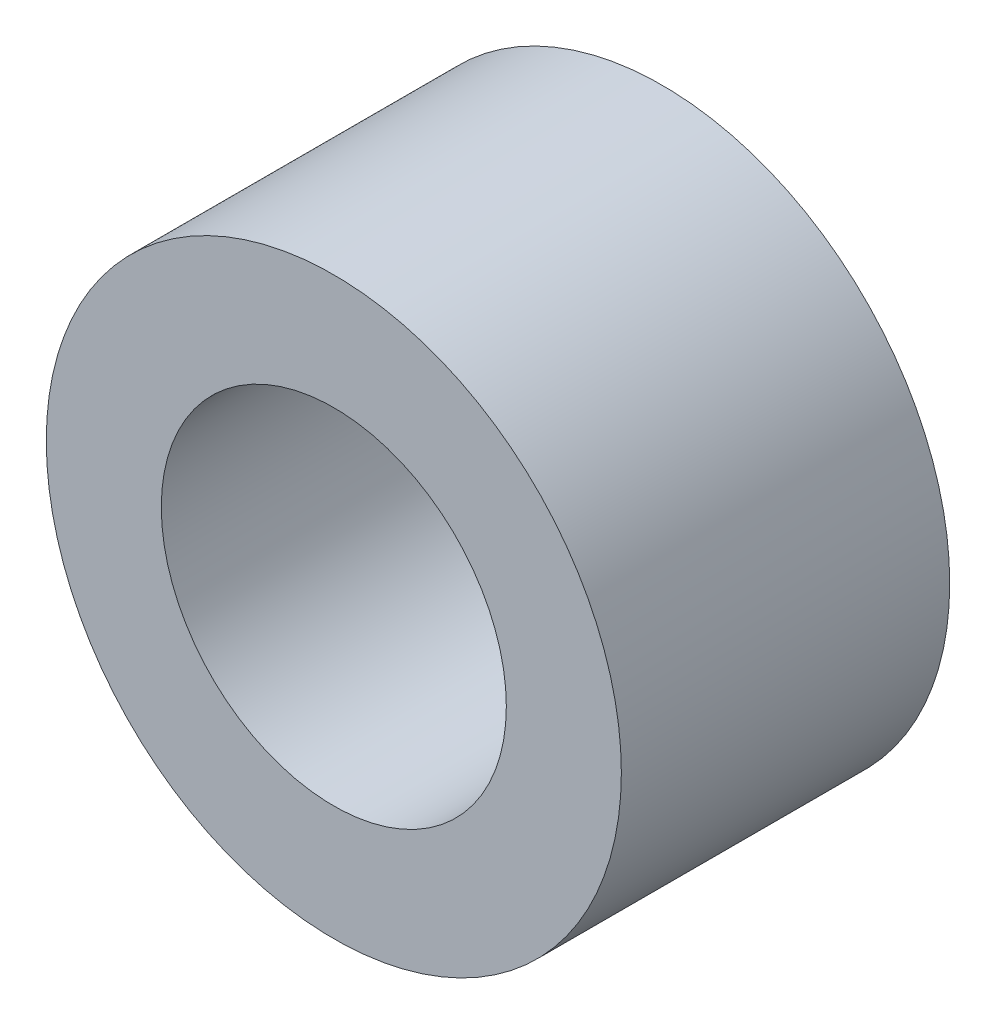
ISO-10303-21;
HEADER;
FILE_DESCRIPTION(('STEP AP214'),'2;1');
FILE_NAME('part.step','',(''),(''),'','','');
FILE_SCHEMA(('AUTOMOTIVE_DESIGN { 1 0 10303 214 1 1 1 1 }'));
ENDSEC;
DATA;
#1=APPLICATION_CONTEXT('core data for automotive mechanical design processes');
#2=APPLICATION_PROTOCOL_DEFINITION('international standard','automotive_design',2000,#1);
#3=PRODUCT_CONTEXT('',#1,'mechanical');
#4=PRODUCT('Part','Part','',(#3));
#5=PRODUCT_RELATED_PRODUCT_CATEGORY('part','',(#4));
#6=PRODUCT_DEFINITION_FORMATION('','',#4);
#7=PRODUCT_DEFINITION_CONTEXT('part definition',#1,'design');
#8=PRODUCT_DEFINITION('design','',#6,#7);
#9=PRODUCT_DEFINITION_SHAPE('','',#8);
#10=(LENGTH_UNIT() NAMED_UNIT(*) SI_UNIT(.MILLI.,.METRE.));
#11=(NAMED_UNIT(*) PLANE_ANGLE_UNIT() SI_UNIT($,.RADIAN.));
#12=(NAMED_UNIT(*) SI_UNIT($,.STERADIAN.) SOLID_ANGLE_UNIT());
#13=UNCERTAINTY_MEASURE_WITH_UNIT(LENGTH_MEASURE(1.E-05),#10,'distance_accuracy_value','');
#14=(GEOMETRIC_REPRESENTATION_CONTEXT(3) GLOBAL_UNCERTAINTY_ASSIGNED_CONTEXT((#13)) GLOBAL_UNIT_ASSIGNED_CONTEXT((#10,
#11,#12)) REPRESENTATION_CONTEXT('',''));
#15=CARTESIAN_POINT('',(0.,0.,0.));
#16=DIRECTION('',(0.,0.,1.));
#17=DIRECTION('',(1.,0.,0.));
#18=AXIS2_PLACEMENT_3D('',#15,#16,#17);
#19=CARTESIAN_POINT('',(0.,0.,14.5034));
#20=DIRECTION('',(0.,0.,1.));
#21=DIRECTION('',(1.,0.,0.));
#22=AXIS2_PLACEMENT_3D('',#19,#20,#21);
#23=PLANE('',#22);
#24=CARTESIAN_POINT('',(0.,0.,14.5034));
#25=DIRECTION('',(0.,0.,1.));
#26=DIRECTION('',(1.,0.,0.));
#27=AXIS2_PLACEMENT_3D('',#24,#25,#26);
#28=CIRCLE('',#27,12.7);
#29=CARTESIAN_POINT('',(12.7,0.,14.5034));
#30=VERTEX_POINT('',#29);
#31=EDGE_CURVE('E10',#30,#30,#28,.T.);
#32=ORIENTED_EDGE('',*,*,#31,.T.);
#33=EDGE_LOOP('',(#32));
#34=FACE_BOUND('',#33,.T.);
#35=CARTESIAN_POINT('',(0.,0.,14.5034));
#36=DIRECTION('',(0.,0.,1.));
#37=DIRECTION('',(1.,0.,0.));
#38=AXIS2_PLACEMENT_3D('',#35,#36,#37);
#39=CIRCLE('',#38,7.62);
#40=CARTESIAN_POINT('',(7.62,0.,14.5034));
#41=VERTEX_POINT('',#40);
#42=EDGE_CURVE('E44',#41,#41,#39,.T.);
#43=ORIENTED_EDGE('',*,*,#42,.F.);
#44=EDGE_LOOP('',(#43));
#45=FACE_BOUND('',#44,.T.);
#46=ADVANCED_FACE('F33',(#34,#45),#23,.T.);
#47=CARTESIAN_POINT('',(0.,0.,0.));
#48=DIRECTION('',(0.,0.,1.));
#49=DIRECTION('',(1.,0.,0.));
#50=AXIS2_PLACEMENT_3D('',#47,#48,#49);
#51=PLANE('',#50);
#52=CARTESIAN_POINT('',(0.,0.,0.));
#53=DIRECTION('',(0.,0.,1.));
#54=DIRECTION('',(1.,0.,0.));
#55=AXIS2_PLACEMENT_3D('',#52,#53,#54);
#56=CIRCLE('',#55,12.7);
#57=CARTESIAN_POINT('',(12.7,0.,0.));
#58=VERTEX_POINT('',#57);
#59=EDGE_CURVE('E37',#58,#58,#56,.T.);
#60=ORIENTED_EDGE('',*,*,#59,.F.);
#61=EDGE_LOOP('',(#60));
#62=FACE_BOUND('',#61,.T.);
#63=CARTESIAN_POINT('',(0.,0.,0.));
#64=DIRECTION('',(0.,0.,1.));
#65=DIRECTION('',(1.,0.,0.));
#66=AXIS2_PLACEMENT_3D('',#63,#64,#65);
#67=CIRCLE('',#66,7.62);
#68=CARTESIAN_POINT('',(7.62,0.,0.));
#69=VERTEX_POINT('',#68);
#70=EDGE_CURVE('E46',#69,#69,#67,.T.);
#71=ORIENTED_EDGE('',*,*,#70,.T.);
#72=EDGE_LOOP('',(#71));
#73=FACE_BOUND('',#72,.T.);
#74=ADVANCED_FACE('F56',(#62,#73),#51,.F.);
#75=CARTESIAN_POINT('',(0.,0.,14.5034));
#76=DIRECTION('',(0.,0.,-1.));
#77=DIRECTION('',(-1.,0.,0.));
#78=AXIS2_PLACEMENT_3D('',#75,#76,#77);
#79=CYLINDRICAL_SURFACE('',#78,12.7);
#80=ORIENTED_EDGE('',*,*,#31,.F.);
#81=EDGE_LOOP('',(#80));
#82=FACE_BOUND('',#81,.T.);
#83=ORIENTED_EDGE('',*,*,#59,.T.);
#84=EDGE_LOOP('',(#83));
#85=FACE_BOUND('',#84,.T.);
#86=ADVANCED_FACE('F35',(#82,#85),#79,.T.);
#87=CARTESIAN_POINT('',(0.,0.,14.5034));
#88=DIRECTION('',(0.,0.,-1.));
#89=DIRECTION('',(-1.,0.,0.));
#90=AXIS2_PLACEMENT_3D('',#87,#88,#89);
#91=CYLINDRICAL_SURFACE('',#90,7.62);
#92=ORIENTED_EDGE('',*,*,#42,.T.);
#93=EDGE_LOOP('',(#92));
#94=FACE_BOUND('',#93,.T.);
#95=ORIENTED_EDGE('',*,*,#70,.F.);
#96=EDGE_LOOP('',(#95));
#97=FACE_BOUND('',#96,.T.);
#98=ADVANCED_FACE('F52',(#94,#97),#91,.F.);
#99=CLOSED_SHELL('',(#46,#74,#86,#98));
#100=MANIFOLD_SOLID_BREP('B2',#99);
#101=ADVANCED_BREP_SHAPE_REPRESENTATION('',(#18,#100),#14);
#102=SHAPE_DEFINITION_REPRESENTATION(#9,#101);
ENDSEC;
END-ISO-10303-21;
